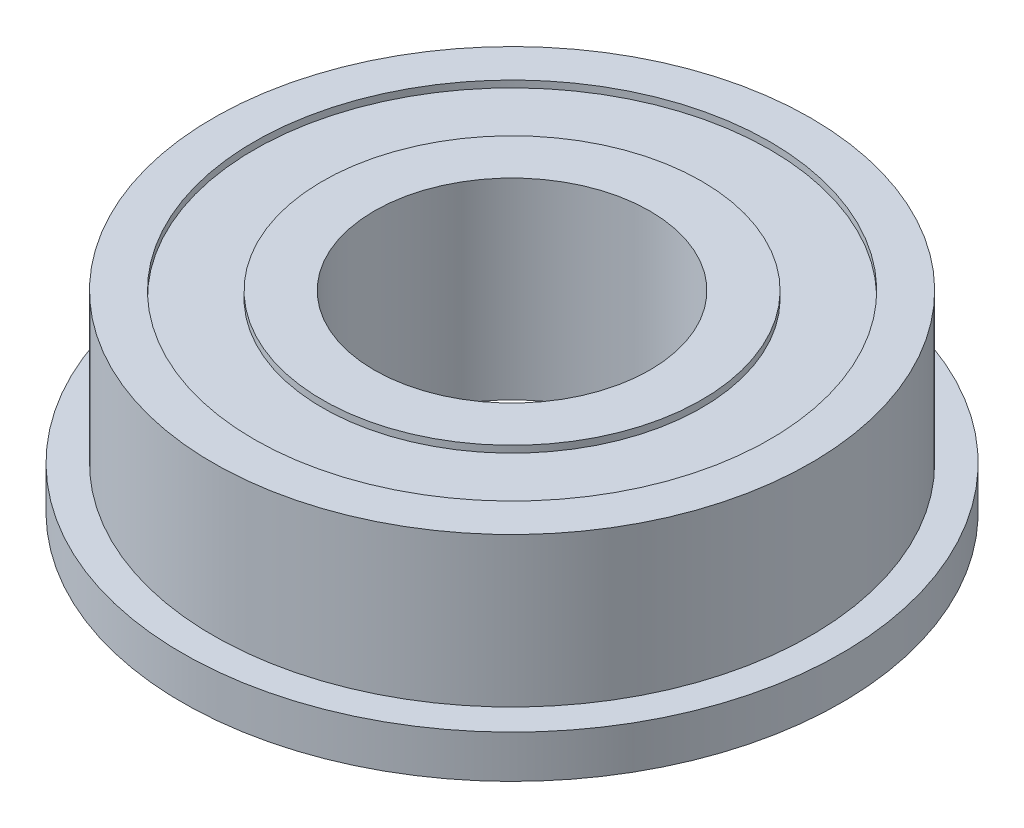
ISO-10303-21;
HEADER;
FILE_DESCRIPTION(('STEP AP214'),'2;1');
FILE_NAME('part.step','',(''),(''),'','','');
FILE_SCHEMA(('AUTOMOTIVE_DESIGN { 1 0 10303 214 1 1 1 1 }'));
ENDSEC;
DATA;
#1=APPLICATION_CONTEXT('core data for automotive mechanical design processes');
#2=APPLICATION_PROTOCOL_DEFINITION('international standard','automotive_design',2000,#1);
#3=PRODUCT_CONTEXT('',#1,'mechanical');
#4=PRODUCT('Part','Part','',(#3));
#5=PRODUCT_RELATED_PRODUCT_CATEGORY('part','',(#4));
#6=PRODUCT_DEFINITION_FORMATION('','',#4);
#7=PRODUCT_DEFINITION_CONTEXT('part definition',#1,'design');
#8=PRODUCT_DEFINITION('design','',#6,#7);
#9=PRODUCT_DEFINITION_SHAPE('','',#8);
#10=(LENGTH_UNIT() NAMED_UNIT(*) SI_UNIT(.MILLI.,.METRE.));
#11=(NAMED_UNIT(*) PLANE_ANGLE_UNIT() SI_UNIT($,.RADIAN.));
#12=(NAMED_UNIT(*) SI_UNIT($,.STERADIAN.) SOLID_ANGLE_UNIT());
#13=UNCERTAINTY_MEASURE_WITH_UNIT(LENGTH_MEASURE(1.E-05),#10,'distance_accuracy_value','');
#14=(GEOMETRIC_REPRESENTATION_CONTEXT(3) GLOBAL_UNCERTAINTY_ASSIGNED_CONTEXT((#13)) GLOBAL_UNIT_ASSIGNED_CONTEXT((#10,
#11,#12)) REPRESENTATION_CONTEXT('',''));
#15=CARTESIAN_POINT('',(0.,0.,0.));
#16=DIRECTION('',(0.,0.,1.));
#17=DIRECTION('',(1.,0.,0.));
#18=AXIS2_PLACEMENT_3D('',#15,#16,#17);
#19=CARTESIAN_POINT('',(-7.0485,0.,0.));
#20=DIRECTION('',(0.,1.,0.));
#21=DIRECTION('',(0.,0.,1.));
#22=AXIS2_PLACEMENT_3D('',#19,#20,#21);
#23=PLANE('',#22);
#24=CARTESIAN_POINT('',(0.,0.,0.));
#25=DIRECTION('',(0.,-1.,0.));
#26=DIRECTION('',(0.,0.,-1.));
#27=AXIS2_PLACEMENT_3D('',#24,#25,#26);
#28=CIRCLE('',#27,5.125);
#29=CARTESIAN_POINT('',(0.,0.,-5.125));
#30=VERTEX_POINT('',#29);
#31=EDGE_CURVE('E10',#30,#30,#28,.T.);
#32=ORIENTED_EDGE('',*,*,#31,.F.);
#33=EDGE_LOOP('',(#32));
#34=FACE_BOUND('',#33,.T.);
#35=CARTESIAN_POINT('',(0.,0.,0.));
#36=DIRECTION('',(0.,-1.,0.));
#37=DIRECTION('',(0.,0.,-1.));
#38=AXIS2_PLACEMENT_3D('',#35,#36,#37);
#39=CIRCLE('',#38,7.0485);
#40=CARTESIAN_POINT('',(0.,0.,-7.0485));
#41=VERTEX_POINT('',#40);
#42=EDGE_CURVE('E60',#41,#41,#39,.T.);
#43=ORIENTED_EDGE('',*,*,#42,.T.);
#44=EDGE_LOOP('',(#43));
#45=FACE_BOUND('',#44,.T.);
#46=ADVANCED_FACE('F14',(#34,#45),#23,.F.);
#47=CARTESIAN_POINT('',(0.,0.,0.));
#48=DIRECTION('',(0.,-1.,0.));
#49=DIRECTION('',(0.,0.,-1.));
#50=AXIS2_PLACEMENT_3D('',#47,#48,#49);
#51=CYLINDRICAL_SURFACE('',#50,5.125);
#52=CARTESIAN_POINT('',(0.,7.14375,0.));
#53=DIRECTION('',(0.,-1.,0.));
#54=DIRECTION('',(0.,0.,-1.));
#55=AXIS2_PLACEMENT_3D('',#52,#53,#54);
#56=CIRCLE('',#55,5.125);
#57=CARTESIAN_POINT('',(0.,7.14375,-5.125));
#58=VERTEX_POINT('',#57);
#59=EDGE_CURVE('E20',#58,#58,#56,.T.);
#60=ORIENTED_EDGE('',*,*,#59,.F.);
#61=EDGE_LOOP('',(#60));
#62=FACE_BOUND('',#61,.T.);
#63=ORIENTED_EDGE('',*,*,#31,.T.);
#64=EDGE_LOOP('',(#63));
#65=FACE_BOUND('',#64,.T.);
#66=ADVANCED_FACE('F133',(#62,#65),#51,.F.);
#67=CARTESIAN_POINT('',(-5.125,7.14375,0.));
#68=DIRECTION('',(0.,-1.,0.));
#69=DIRECTION('',(0.,0.,-1.));
#70=AXIS2_PLACEMENT_3D('',#67,#68,#69);
#71=PLANE('',#70);
#72=CARTESIAN_POINT('',(0.,7.14375,0.));
#73=DIRECTION('',(0.,-1.,0.));
#74=DIRECTION('',(0.,0.,-1.));
#75=AXIS2_PLACEMENT_3D('',#72,#73,#74);
#76=CIRCLE('',#75,7.0485);
#77=CARTESIAN_POINT('',(0.,7.14375,-7.0485));
#78=VERTEX_POINT('',#77);
#79=EDGE_CURVE('E24',#78,#78,#76,.T.);
#80=ORIENTED_EDGE('',*,*,#79,.F.);
#81=EDGE_LOOP('',(#80));
#82=FACE_BOUND('',#81,.T.);
#83=ORIENTED_EDGE('',*,*,#59,.T.);
#84=EDGE_LOOP('',(#83));
#85=FACE_BOUND('',#84,.T.);
#86=ADVANCED_FACE('F128',(#82,#85),#71,.F.);
#87=CARTESIAN_POINT('',(0.,0.,0.));
#88=DIRECTION('',(0.,-1.,0.));
#89=DIRECTION('',(0.,0.,-1.));
#90=AXIS2_PLACEMENT_3D('',#87,#88,#89);
#91=CYLINDRICAL_SURFACE('',#90,7.0485);
#92=CARTESIAN_POINT('',(0.,6.88975,0.));
#93=DIRECTION('',(0.,-1.,0.));
#94=DIRECTION('',(0.,0.,-1.));
#95=AXIS2_PLACEMENT_3D('',#92,#93,#94);
#96=CIRCLE('',#95,7.0485);
#97=CARTESIAN_POINT('',(0.,6.88975,-7.0485));
#98=VERTEX_POINT('',#97);
#99=EDGE_CURVE('E28',#98,#98,#96,.T.);
#100=ORIENTED_EDGE('',*,*,#99,.F.);
#101=EDGE_LOOP('',(#100));
#102=FACE_BOUND('',#101,.T.);
#103=ORIENTED_EDGE('',*,*,#79,.T.);
#104=EDGE_LOOP('',(#103));
#105=FACE_BOUND('',#104,.T.);
#106=ADVANCED_FACE('F122',(#102,#105),#91,.T.);
#107=CARTESIAN_POINT('',(-9.5885,6.88975,0.));
#108=DIRECTION('',(0.,-1.,0.));
#109=DIRECTION('',(0.,0.,-1.));
#110=AXIS2_PLACEMENT_3D('',#107,#108,#109);
#111=PLANE('',#110);
#112=CARTESIAN_POINT('',(0.,6.88975,0.));
#113=DIRECTION('',(0.,-1.,0.));
#114=DIRECTION('',(0.,0.,-1.));
#115=AXIS2_PLACEMENT_3D('',#112,#113,#114);
#116=CIRCLE('',#115,9.5885);
#117=CARTESIAN_POINT('',(0.,6.88975,-9.5885));
#118=VERTEX_POINT('',#117);
#119=EDGE_CURVE('E33',#118,#118,#116,.T.);
#120=ORIENTED_EDGE('',*,*,#119,.F.);
#121=EDGE_LOOP('',(#120));
#122=FACE_BOUND('',#121,.T.);
#123=ORIENTED_EDGE('',*,*,#99,.T.);
#124=EDGE_LOOP('',(#123));
#125=FACE_BOUND('',#124,.T.);
#126=ADVANCED_FACE('F116',(#122,#125),#111,.F.);
#127=CARTESIAN_POINT('',(0.,0.,0.));
#128=DIRECTION('',(0.,-1.,0.));
#129=DIRECTION('',(0.,0.,-1.));
#130=AXIS2_PLACEMENT_3D('',#127,#128,#129);
#131=CYLINDRICAL_SURFACE('',#130,9.5885);
#132=CARTESIAN_POINT('',(0.,7.14375,0.));
#133=DIRECTION('',(0.,-1.,0.));
#134=DIRECTION('',(0.,0.,-1.));
#135=AXIS2_PLACEMENT_3D('',#132,#133,#134);
#136=CIRCLE('',#135,9.5885);
#137=CARTESIAN_POINT('',(0.,7.14375,-9.5885));
#138=VERTEX_POINT('',#137);
#139=EDGE_CURVE('E36',#138,#138,#136,.T.);
#140=ORIENTED_EDGE('',*,*,#139,.F.);
#141=EDGE_LOOP('',(#140));
#142=FACE_BOUND('',#141,.T.);
#143=ORIENTED_EDGE('',*,*,#119,.T.);
#144=EDGE_LOOP('',(#143));
#145=FACE_BOUND('',#144,.T.);
#146=ADVANCED_FACE('F110',(#142,#145),#131,.F.);
#147=CARTESIAN_POINT('',(-9.5885,7.14375,0.));
#148=DIRECTION('',(0.,-1.,0.));
#149=DIRECTION('',(0.,0.,-1.));
#150=AXIS2_PLACEMENT_3D('',#147,#148,#149);
#151=PLANE('',#150);
#152=CARTESIAN_POINT('',(0.,7.14375,0.));
#153=DIRECTION('',(0.,-1.,0.));
#154=DIRECTION('',(0.,0.,-1.));
#155=AXIS2_PLACEMENT_3D('',#152,#153,#154);
#156=CIRCLE('',#155,11.1125);
#157=CARTESIAN_POINT('',(0.,7.14375,-11.1125));
#158=VERTEX_POINT('',#157);
#159=EDGE_CURVE('E39',#158,#158,#156,.T.);
#160=ORIENTED_EDGE('',*,*,#159,.F.);
#161=EDGE_LOOP('',(#160));
#162=FACE_BOUND('',#161,.T.);
#163=ORIENTED_EDGE('',*,*,#139,.T.);
#164=EDGE_LOOP('',(#163));
#165=FACE_BOUND('',#164,.T.);
#166=ADVANCED_FACE('F104',(#162,#165),#151,.F.);
#167=CARTESIAN_POINT('',(0.,0.,0.));
#168=DIRECTION('',(0.,-1.,0.));
#169=DIRECTION('',(0.,0.,-1.));
#170=AXIS2_PLACEMENT_3D('',#167,#168,#169);
#171=CYLINDRICAL_SURFACE('',#170,11.1125);
#172=CARTESIAN_POINT('',(0.,1.5875,0.));
#173=DIRECTION('',(0.,-1.,0.));
#174=DIRECTION('',(0.,0.,-1.));
#175=AXIS2_PLACEMENT_3D('',#172,#173,#174);
#176=CIRCLE('',#175,11.1125);
#177=CARTESIAN_POINT('',(0.,1.5875,-11.1125));
#178=VERTEX_POINT('',#177);
#179=EDGE_CURVE('E42',#178,#178,#176,.T.);
#180=ORIENTED_EDGE('',*,*,#179,.F.);
#181=EDGE_LOOP('',(#180));
#182=FACE_BOUND('',#181,.T.);
#183=ORIENTED_EDGE('',*,*,#159,.T.);
#184=EDGE_LOOP('',(#183));
#185=FACE_BOUND('',#184,.T.);
#186=ADVANCED_FACE('F98',(#182,#185),#171,.T.);
#187=CARTESIAN_POINT('',(-11.1125,1.5875,0.));
#188=DIRECTION('',(0.,-1.,0.));
#189=DIRECTION('',(0.,0.,-1.));
#190=AXIS2_PLACEMENT_3D('',#187,#188,#189);
#191=PLANE('',#190);
#192=CARTESIAN_POINT('',(0.,1.5875,0.));
#193=DIRECTION('',(0.,-1.,0.));
#194=DIRECTION('',(0.,0.,-1.));
#195=AXIS2_PLACEMENT_3D('',#192,#193,#194);
#196=CIRCLE('',#195,12.2555);
#197=CARTESIAN_POINT('',(0.,1.5875,-12.2555));
#198=VERTEX_POINT('',#197);
#199=EDGE_CURVE('E45',#198,#198,#196,.T.);
#200=ORIENTED_EDGE('',*,*,#199,.F.);
#201=EDGE_LOOP('',(#200));
#202=FACE_BOUND('',#201,.T.);
#203=ORIENTED_EDGE('',*,*,#179,.T.);
#204=EDGE_LOOP('',(#203));
#205=FACE_BOUND('',#204,.T.);
#206=ADVANCED_FACE('F92',(#202,#205),#191,.F.);
#207=CARTESIAN_POINT('',(0.,0.,0.));
#208=DIRECTION('',(0.,-1.,0.));
#209=DIRECTION('',(0.,0.,-1.));
#210=AXIS2_PLACEMENT_3D('',#207,#208,#209);
#211=CYLINDRICAL_SURFACE('',#210,12.2555);
#212=CARTESIAN_POINT('',(0.,0.,0.));
#213=DIRECTION('',(0.,-1.,0.));
#214=DIRECTION('',(0.,0.,-1.));
#215=AXIS2_PLACEMENT_3D('',#212,#213,#214);
#216=CIRCLE('',#215,12.2555);
#217=CARTESIAN_POINT('',(0.,0.,-12.2555));
#218=VERTEX_POINT('',#217);
#219=EDGE_CURVE('E48',#218,#218,#216,.T.);
#220=ORIENTED_EDGE('',*,*,#219,.F.);
#221=EDGE_LOOP('',(#220));
#222=FACE_BOUND('',#221,.T.);
#223=ORIENTED_EDGE('',*,*,#199,.T.);
#224=EDGE_LOOP('',(#223));
#225=FACE_BOUND('',#224,.T.);
#226=ADVANCED_FACE('F86',(#222,#225),#211,.T.);
#227=CARTESIAN_POINT('',(-12.2555,0.,0.));
#228=DIRECTION('',(0.,1.,0.));
#229=DIRECTION('',(0.,0.,1.));
#230=AXIS2_PLACEMENT_3D('',#227,#228,#229);
#231=PLANE('',#230);
#232=CARTESIAN_POINT('',(0.,0.,0.));
#233=DIRECTION('',(0.,-1.,0.));
#234=DIRECTION('',(0.,0.,-1.));
#235=AXIS2_PLACEMENT_3D('',#232,#233,#234);
#236=CIRCLE('',#235,9.5885);
#237=CARTESIAN_POINT('',(0.,0.,-9.5885));
#238=VERTEX_POINT('',#237);
#239=EDGE_CURVE('E51',#238,#238,#236,.T.);
#240=ORIENTED_EDGE('',*,*,#239,.F.);
#241=EDGE_LOOP('',(#240));
#242=FACE_BOUND('',#241,.T.);
#243=ORIENTED_EDGE('',*,*,#219,.T.);
#244=EDGE_LOOP('',(#243));
#245=FACE_BOUND('',#244,.T.);
#246=ADVANCED_FACE('F80',(#242,#245),#231,.F.);
#247=CARTESIAN_POINT('',(0.,0.,0.));
#248=DIRECTION('',(0.,-1.,0.));
#249=DIRECTION('',(0.,0.,-1.));
#250=AXIS2_PLACEMENT_3D('',#247,#248,#249);
#251=CYLINDRICAL_SURFACE('',#250,9.5885);
#252=CARTESIAN_POINT('',(0.,0.254,0.));
#253=DIRECTION('',(0.,-1.,0.));
#254=DIRECTION('',(0.,0.,-1.));
#255=AXIS2_PLACEMENT_3D('',#252,#253,#254);
#256=CIRCLE('',#255,9.5885);
#257=CARTESIAN_POINT('',(0.,0.254,-9.5885));
#258=VERTEX_POINT('',#257);
#259=EDGE_CURVE('E54',#258,#258,#256,.T.);
#260=ORIENTED_EDGE('',*,*,#259,.F.);
#261=EDGE_LOOP('',(#260));
#262=FACE_BOUND('',#261,.T.);
#263=ORIENTED_EDGE('',*,*,#239,.T.);
#264=EDGE_LOOP('',(#263));
#265=FACE_BOUND('',#264,.T.);
#266=ADVANCED_FACE('F74',(#262,#265),#251,.F.);
#267=CARTESIAN_POINT('',(-9.5885,0.254,0.));
#268=DIRECTION('',(0.,1.,0.));
#269=DIRECTION('',(0.,0.,1.));
#270=AXIS2_PLACEMENT_3D('',#267,#268,#269);
#271=PLANE('',#270);
#272=CARTESIAN_POINT('',(0.,0.254,0.));
#273=DIRECTION('',(0.,-1.,0.));
#274=DIRECTION('',(0.,0.,-1.));
#275=AXIS2_PLACEMENT_3D('',#272,#273,#274);
#276=CIRCLE('',#275,7.0485);
#277=CARTESIAN_POINT('',(0.,0.254,-7.0485));
#278=VERTEX_POINT('',#277);
#279=EDGE_CURVE('E57',#278,#278,#276,.T.);
#280=ORIENTED_EDGE('',*,*,#279,.F.);
#281=EDGE_LOOP('',(#280));
#282=FACE_BOUND('',#281,.T.);
#283=ORIENTED_EDGE('',*,*,#259,.T.);
#284=EDGE_LOOP('',(#283));
#285=FACE_BOUND('',#284,.T.);
#286=ADVANCED_FACE('F68',(#282,#285),#271,.F.);
#287=CARTESIAN_POINT('',(0.,0.,0.));
#288=DIRECTION('',(0.,-1.,0.));
#289=DIRECTION('',(0.,0.,-1.));
#290=AXIS2_PLACEMENT_3D('',#287,#288,#289);
#291=CYLINDRICAL_SURFACE('',#290,7.0485);
#292=ORIENTED_EDGE('',*,*,#42,.F.);
#293=EDGE_LOOP('',(#292));
#294=FACE_BOUND('',#293,.T.);
#295=ORIENTED_EDGE('',*,*,#279,.T.);
#296=EDGE_LOOP('',(#295));
#297=FACE_BOUND('',#296,.T.);
#298=ADVANCED_FACE('F65',(#294,#297),#291,.T.);
#299=CLOSED_SHELL('',(#46,#66,#86,#106,#126,#146,#166,#186,#206,#226,#246,#266,#286,#298));
#300=MANIFOLD_SOLID_BREP('B1',#299);
#301=ADVANCED_BREP_SHAPE_REPRESENTATION('',(#18,#300),#14);
#302=SHAPE_DEFINITION_REPRESENTATION(#9,#301);
ENDSEC;
END-ISO-10303-21;
